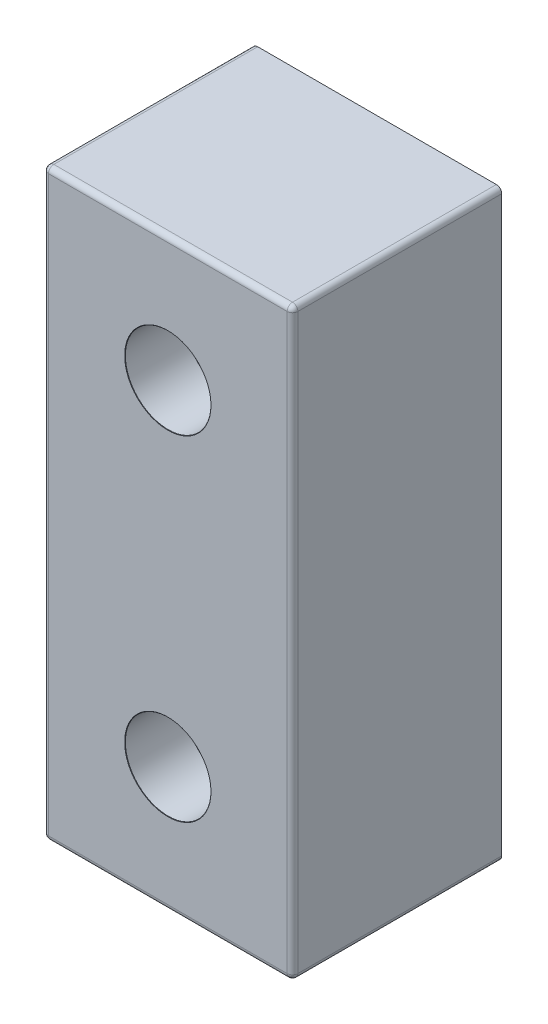
ISO-10303-21;
HEADER;
FILE_DESCRIPTION(('STEP AP214'),'2;1');
FILE_NAME('part.step','',(''),(''),'','','');
FILE_SCHEMA(('AUTOMOTIVE_DESIGN { 1 0 10303 214 1 1 1 1 }'));
ENDSEC;
DATA;
#1=APPLICATION_CONTEXT('core data for automotive mechanical design processes');
#2=APPLICATION_PROTOCOL_DEFINITION('international standard','automotive_design',2000,#1);
#3=PRODUCT_CONTEXT('',#1,'mechanical');
#4=PRODUCT('Part','Part','',(#3));
#5=PRODUCT_RELATED_PRODUCT_CATEGORY('part','',(#4));
#6=PRODUCT_DEFINITION_FORMATION('','',#4);
#7=PRODUCT_DEFINITION_CONTEXT('part definition',#1,'design');
#8=PRODUCT_DEFINITION('design','',#6,#7);
#9=PRODUCT_DEFINITION_SHAPE('','',#8);
#10=(LENGTH_UNIT() NAMED_UNIT(*) SI_UNIT(.MILLI.,.METRE.));
#11=(NAMED_UNIT(*) PLANE_ANGLE_UNIT() SI_UNIT($,.RADIAN.));
#12=(NAMED_UNIT(*) SI_UNIT($,.STERADIAN.) SOLID_ANGLE_UNIT());
#13=UNCERTAINTY_MEASURE_WITH_UNIT(LENGTH_MEASURE(1.E-05),#10,'distance_accuracy_value','');
#14=(GEOMETRIC_REPRESENTATION_CONTEXT(3) GLOBAL_UNCERTAINTY_ASSIGNED_CONTEXT((#13)) GLOBAL_UNIT_ASSIGNED_CONTEXT((#10,
#11,#12)) REPRESENTATION_CONTEXT('',''));
#15=CARTESIAN_POINT('',(0.,0.,0.));
#16=DIRECTION('',(0.,0.,1.));
#17=DIRECTION('',(1.,0.,0.));
#18=AXIS2_PLACEMENT_3D('',#15,#16,#17);
#19=CARTESIAN_POINT('',(0.,0.,15.875));
#20=DIRECTION('',(0.,1.,0.));
#21=DIRECTION('',(0.,0.,1.));
#22=AXIS2_PLACEMENT_3D('',#19,#20,#21);
#23=PLANE('',#22);
#24=DIRECTION('',(1.,0.,0.));
#25=VECTOR('',#24,1.);
#26=CARTESIAN_POINT('',(0.,0.,15.4686));
#27=LINE('',#26,#25);
#28=CARTESIAN_POINT('',(18.5166,0.,15.4686));
#29=VERTEX_POINT('',#28);
#30=CARTESIAN_POINT('',(0.4064,0.,15.4686));
#31=VERTEX_POINT('',#30);
#32=EDGE_CURVE('E60',#29,#31,#27,.F.);
#33=ORIENTED_EDGE('',*,*,#32,.T.);
#34=DIRECTION('',(0.,0.,-1.));
#35=VECTOR('',#34,1.);
#36=CARTESIAN_POINT('',(0.4064,0.,0.));
#37=LINE('',#36,#35);
#38=CARTESIAN_POINT('',(0.4064,0.,0.));
#39=VERTEX_POINT('',#38);
#40=EDGE_CURVE('E185',#31,#39,#37,.T.);
#41=ORIENTED_EDGE('',*,*,#40,.T.);
#42=DIRECTION('',(1.,0.,0.));
#43=VECTOR('',#42,1.);
#44=CARTESIAN_POINT('',(0.,0.,0.));
#45=LINE('',#44,#43);
#46=CARTESIAN_POINT('',(18.5166,0.,0.));
#47=VERTEX_POINT('',#46);
#48=EDGE_CURVE('E126',#39,#47,#45,.T.);
#49=ORIENTED_EDGE('',*,*,#48,.T.);
#50=DIRECTION('',(0.,0.,-1.));
#51=VECTOR('',#50,1.);
#52=CARTESIAN_POINT('',(18.5166,0.,15.875));
#53=LINE('',#52,#51);
#54=EDGE_CURVE('E65',#47,#29,#53,.F.);
#55=ORIENTED_EDGE('',*,*,#54,.T.);
#56=EDGE_LOOP('',(#33,#41,#49,#55));
#57=FACE_BOUND('',#56,.T.);
#58=ADVANCED_FACE('F42',(#57),#23,.F.);
#59=CARTESIAN_POINT('',(18.923,0.,15.875));
#60=DIRECTION('',(-1.,0.,0.));
#61=DIRECTION('',(0.,0.,1.));
#62=AXIS2_PLACEMENT_3D('',#59,#60,#61);
#63=PLANE('',#62);
#64=DIRECTION('',(0.,1.,0.));
#65=VECTOR('',#64,1.);
#66=CARTESIAN_POINT('',(18.923,0.,15.4686));
#67=LINE('',#66,#65);
#68=CARTESIAN_POINT('',(18.923,43.9166,15.4686));
#69=VERTEX_POINT('',#68);
#70=CARTESIAN_POINT('',(18.923,0.4064,15.4686));
#71=VERTEX_POINT('',#70);
#72=EDGE_CURVE('E175',#69,#71,#67,.F.);
#73=ORIENTED_EDGE('',*,*,#72,.T.);
#74=DIRECTION('',(0.,0.,-1.));
#75=VECTOR('',#74,1.);
#76=CARTESIAN_POINT('',(18.923,0.4064,15.875));
#77=LINE('',#76,#75);
#78=CARTESIAN_POINT('',(18.923,0.4064,0.));
#79=VERTEX_POINT('',#78);
#80=EDGE_CURVE('E178',#71,#79,#77,.T.);
#81=ORIENTED_EDGE('',*,*,#80,.T.);
#82=DIRECTION('',(0.,1.,0.));
#83=VECTOR('',#82,1.);
#84=CARTESIAN_POINT('',(18.923,0.,0.));
#85=LINE('',#84,#83);
#86=CARTESIAN_POINT('',(18.923,43.9166,0.));
#87=VERTEX_POINT('',#86);
#88=EDGE_CURVE('E241',#79,#87,#85,.T.);
#89=ORIENTED_EDGE('',*,*,#88,.T.);
#90=DIRECTION('',(0.,0.,-1.));
#91=VECTOR('',#90,1.);
#92=CARTESIAN_POINT('',(18.923,43.9166,15.875));
#93=LINE('',#92,#91);
#94=EDGE_CURVE('E172',#87,#69,#93,.F.);
#95=ORIENTED_EDGE('',*,*,#94,.T.);
#96=EDGE_LOOP('',(#73,#81,#89,#95));
#97=FACE_BOUND('',#96,.T.);
#98=ADVANCED_FACE('F264',(#97),#63,.F.);
#99=CARTESIAN_POINT('',(0.,44.323,15.875));
#100=DIRECTION('',(0.,1.,0.));
#101=DIRECTION('',(0.,0.,1.));
#102=AXIS2_PLACEMENT_3D('',#99,#100,#101);
#103=PLANE('',#102);
#104=DIRECTION('',(1.,0.,0.));
#105=VECTOR('',#104,1.);
#106=CARTESIAN_POINT('',(0.,44.323,0.));
#107=LINE('',#106,#105);
#108=CARTESIAN_POINT('',(0.4064,44.323,0.));
#109=VERTEX_POINT('',#108);
#110=CARTESIAN_POINT('',(18.5166,44.323,0.));
#111=VERTEX_POINT('',#110);
#112=EDGE_CURVE('E137',#109,#111,#107,.T.);
#113=ORIENTED_EDGE('',*,*,#112,.F.);
#114=DIRECTION('',(0.,0.,-1.));
#115=VECTOR('',#114,1.);
#116=CARTESIAN_POINT('',(0.4064,44.323,15.875));
#117=LINE('',#116,#115);
#118=CARTESIAN_POINT('',(0.4064,44.323,15.4686));
#119=VERTEX_POINT('',#118);
#120=EDGE_CURVE('E169',#109,#119,#117,.F.);
#121=ORIENTED_EDGE('',*,*,#120,.T.);
#122=DIRECTION('',(1.,0.,0.));
#123=VECTOR('',#122,1.);
#124=CARTESIAN_POINT('',(0.,44.323,15.4686));
#125=LINE('',#124,#123);
#126=CARTESIAN_POINT('',(18.5166,44.323,15.4686));
#127=VERTEX_POINT('',#126);
#128=EDGE_CURVE('E166',#119,#127,#125,.T.);
#129=ORIENTED_EDGE('',*,*,#128,.T.);
#130=DIRECTION('',(0.,0.,-1.));
#131=VECTOR('',#130,1.);
#132=CARTESIAN_POINT('',(18.5166,44.323,0.));
#133=LINE('',#132,#131);
#134=EDGE_CURVE('E163',#127,#111,#133,.T.);
#135=ORIENTED_EDGE('',*,*,#134,.T.);
#136=EDGE_LOOP('',(#113,#121,#129,#135));
#137=FACE_BOUND('',#136,.T.);
#138=ADVANCED_FACE('F296',(#137),#103,.T.);
#139=CARTESIAN_POINT('',(0.,0.,15.875));
#140=DIRECTION('',(-1.,0.,0.));
#141=DIRECTION('',(0.,0.,1.));
#142=AXIS2_PLACEMENT_3D('',#139,#140,#141);
#143=PLANE('',#142);
#144=DIRECTION('',(0.,1.,0.));
#145=VECTOR('',#144,1.);
#146=CARTESIAN_POINT('',(0.,0.,0.));
#147=LINE('',#146,#145);
#148=CARTESIAN_POINT('',(0.,0.4064,0.));
#149=VERTEX_POINT('',#148);
#150=CARTESIAN_POINT('',(0.,43.9166,0.));
#151=VERTEX_POINT('',#150);
#152=EDGE_CURVE('E124',#149,#151,#147,.T.);
#153=ORIENTED_EDGE('',*,*,#152,.F.);
#154=DIRECTION('',(0.,0.,-1.));
#155=VECTOR('',#154,1.);
#156=CARTESIAN_POINT('',(0.,0.4064,15.875));
#157=LINE('',#156,#155);
#158=CARTESIAN_POINT('',(0.,0.4064,15.4686));
#159=VERTEX_POINT('',#158);
#160=EDGE_CURVE('E132',#149,#159,#157,.F.);
#161=ORIENTED_EDGE('',*,*,#160,.T.);
#162=DIRECTION('',(0.,1.,0.));
#163=VECTOR('',#162,1.);
#164=CARTESIAN_POINT('',(0.,0.,15.4686));
#165=LINE('',#164,#163);
#166=CARTESIAN_POINT('',(0.,43.9166,15.4686));
#167=VERTEX_POINT('',#166);
#168=EDGE_CURVE('E145',#159,#167,#165,.T.);
#169=ORIENTED_EDGE('',*,*,#168,.T.);
#170=DIRECTION('',(0.,0.,-1.));
#171=VECTOR('',#170,1.);
#172=CARTESIAN_POINT('',(0.,43.9166,15.875));
#173=LINE('',#172,#171);
#174=EDGE_CURVE('E135',#167,#151,#173,.T.);
#175=ORIENTED_EDGE('',*,*,#174,.T.);
#176=EDGE_LOOP('',(#153,#161,#169,#175));
#177=FACE_BOUND('',#176,.T.);
#178=ADVANCED_FACE('F130',(#177),#143,.T.);
#179=CARTESIAN_POINT('',(0.,0.,15.875));
#180=DIRECTION('',(0.,0.,1.));
#181=DIRECTION('',(1.,0.,0.));
#182=AXIS2_PLACEMENT_3D('',#179,#180,#181);
#183=PLANE('',#182);
#184=CARTESIAN_POINT('',(9.4615,9.4615,15.875));
#185=DIRECTION('',(0.,0.,1.));
#186=DIRECTION('',(1.,0.,0.));
#187=AXIS2_PLACEMENT_3D('',#184,#185,#186);
#188=CIRCLE('',#187,3.275);
#189=CARTESIAN_POINT('',(12.7365,9.4615,15.875));
#190=VERTEX_POINT('',#189);
#191=EDGE_CURVE('E574',#190,#190,#188,.T.);
#192=ORIENTED_EDGE('',*,*,#191,.F.);
#193=EDGE_LOOP('',(#192));
#194=FACE_BOUND('',#193,.T.);
#195=CARTESIAN_POINT('',(9.4615,34.8615,15.875));
#196=DIRECTION('',(0.,0.,1.));
#197=DIRECTION('',(1.,0.,0.));
#198=AXIS2_PLACEMENT_3D('',#195,#196,#197);
#199=CIRCLE('',#198,3.275);
#200=CARTESIAN_POINT('',(12.7365,34.8615,15.875));
#201=VERTEX_POINT('',#200);
#202=EDGE_CURVE('E577',#201,#201,#199,.T.);
#203=ORIENTED_EDGE('',*,*,#202,.F.);
#204=EDGE_LOOP('',(#203));
#205=FACE_BOUND('',#204,.T.);
#206=DIRECTION('',(1.,0.,0.));
#207=VECTOR('',#206,1.);
#208=CARTESIAN_POINT('',(0.,43.9166,15.875));
#209=LINE('',#208,#207);
#210=CARTESIAN_POINT('',(18.5166,43.9166,15.875));
#211=VERTEX_POINT('',#210);
#212=CARTESIAN_POINT('',(0.4064,43.9166,15.875));
#213=VERTEX_POINT('',#212);
#214=EDGE_CURVE('E156',#211,#213,#209,.F.);
#215=ORIENTED_EDGE('',*,*,#214,.T.);
#216=DIRECTION('',(0.,1.,0.));
#217=VECTOR('',#216,1.);
#218=CARTESIAN_POINT('',(0.4064,0.,15.875));
#219=LINE('',#218,#217);
#220=CARTESIAN_POINT('',(0.4064,0.4064,15.875));
#221=VERTEX_POINT('',#220);
#222=EDGE_CURVE('E159',#213,#221,#219,.F.);
#223=ORIENTED_EDGE('',*,*,#222,.T.);
#224=DIRECTION('',(1.,0.,0.));
#225=VECTOR('',#224,1.);
#226=CARTESIAN_POINT('',(18.923,0.4064,15.875));
#227=LINE('',#226,#225);
#228=CARTESIAN_POINT('',(18.5166,0.4064,15.875));
#229=VERTEX_POINT('',#228);
#230=EDGE_CURVE('E144',#221,#229,#227,.T.);
#231=ORIENTED_EDGE('',*,*,#230,.T.);
#232=DIRECTION('',(0.,1.,0.));
#233=VECTOR('',#232,1.);
#234=CARTESIAN_POINT('',(18.5166,44.323,15.875));
#235=LINE('',#234,#233);
#236=EDGE_CURVE('E149',#229,#211,#235,.T.);
#237=ORIENTED_EDGE('',*,*,#236,.T.);
#238=EDGE_LOOP('',(#215,#223,#231,#237));
#239=FACE_BOUND('',#238,.T.);
#240=ADVANCED_FACE('F272',(#194,#205,#239),#183,.T.);
#241=CARTESIAN_POINT('',(0.,0.,0.));
#242=DIRECTION('',(0.,0.,1.));
#243=DIRECTION('',(1.,0.,0.));
#244=AXIS2_PLACEMENT_3D('',#241,#242,#243);
#245=PLANE('',#244);
#246=CARTESIAN_POINT('',(9.4615,9.4615,0.));
#247=DIRECTION('',(0.,0.,1.));
#248=DIRECTION('',(1.,0.,0.));
#249=AXIS2_PLACEMENT_3D('',#246,#247,#248);
#250=CIRCLE('',#249,1.6);
#251=CARTESIAN_POINT('',(11.0615,9.4615,0.));
#252=VERTEX_POINT('',#251);
#253=EDGE_CURVE('E581',#252,#252,#250,.T.);
#254=ORIENTED_EDGE('',*,*,#253,.T.);
#255=EDGE_LOOP('',(#254));
#256=FACE_BOUND('',#255,.T.);
#257=CARTESIAN_POINT('',(9.4615,34.8615,0.));
#258=DIRECTION('',(0.,0.,1.));
#259=DIRECTION('',(1.,0.,0.));
#260=AXIS2_PLACEMENT_3D('',#257,#258,#259);
#261=CIRCLE('',#260,1.6);
#262=CARTESIAN_POINT('',(11.0615,34.8615,0.));
#263=VERTEX_POINT('',#262);
#264=EDGE_CURVE('E200',#263,#263,#261,.T.);
#265=ORIENTED_EDGE('',*,*,#264,.T.);
#266=EDGE_LOOP('',(#265));
#267=FACE_BOUND('',#266,.T.);
#268=ORIENTED_EDGE('',*,*,#48,.F.);
#269=CARTESIAN_POINT('',(0.4064,0.4064,0.));
#270=DIRECTION('',(0.,0.,1.));
#271=DIRECTION('',(1.,0.,0.));
#272=AXIS2_PLACEMENT_3D('',#269,#270,#271);
#273=CIRCLE('',#272,0.4064);
#274=EDGE_CURVE('E11',#39,#149,#273,.F.);
#275=ORIENTED_EDGE('',*,*,#274,.T.);
#276=ORIENTED_EDGE('',*,*,#152,.T.);
#277=CARTESIAN_POINT('',(0.4064,43.9166,0.));
#278=DIRECTION('',(0.,0.,1.));
#279=DIRECTION('',(1.,0.,0.));
#280=AXIS2_PLACEMENT_3D('',#277,#278,#279);
#281=CIRCLE('',#280,0.4064);
#282=EDGE_CURVE('E191',#151,#109,#281,.F.);
#283=ORIENTED_EDGE('',*,*,#282,.T.);
#284=ORIENTED_EDGE('',*,*,#112,.T.);
#285=CARTESIAN_POINT('',(18.5166,43.9166,0.));
#286=DIRECTION('',(0.,0.,1.));
#287=DIRECTION('',(1.,0.,0.));
#288=AXIS2_PLACEMENT_3D('',#285,#286,#287);
#289=CIRCLE('',#288,0.4064);
#290=EDGE_CURVE('E188',#111,#87,#289,.F.);
#291=ORIENTED_EDGE('',*,*,#290,.T.);
#292=ORIENTED_EDGE('',*,*,#88,.F.);
#293=CARTESIAN_POINT('',(18.5166,0.4064,0.));
#294=DIRECTION('',(0.,0.,1.));
#295=DIRECTION('',(1.,0.,0.));
#296=AXIS2_PLACEMENT_3D('',#293,#294,#295);
#297=CIRCLE('',#296,0.4064);
#298=EDGE_CURVE('E52',#79,#47,#297,.F.);
#299=ORIENTED_EDGE('',*,*,#298,.T.);
#300=EDGE_LOOP('',(#268,#275,#276,#283,#284,#291,#292,#299));
#301=FACE_BOUND('',#300,.T.);
#302=ADVANCED_FACE('F123',(#256,#267,#301),#245,.F.);
#303=CARTESIAN_POINT('',(18.5166,0.4064,15.875));
#304=DIRECTION('',(0.,0.,-1.));
#305=DIRECTION('',(-1.,0.,0.));
#306=AXIS2_PLACEMENT_3D('',#303,#304,#305);
#307=CYLINDRICAL_SURFACE('',#306,0.4064);
#308=ORIENTED_EDGE('',*,*,#298,.F.);
#309=ORIENTED_EDGE('',*,*,#80,.F.);
#310=CARTESIAN_POINT('',(18.5166,0.4064,15.4686));
#311=DIRECTION('',(0.,0.,1.));
#312=DIRECTION('',(1.,0.,0.));
#313=AXIS2_PLACEMENT_3D('',#310,#311,#312);
#314=CIRCLE('',#313,0.4064);
#315=EDGE_CURVE('E232',#29,#71,#314,.T.);
#316=ORIENTED_EDGE('',*,*,#315,.F.);
#317=ORIENTED_EDGE('',*,*,#54,.F.);
#318=EDGE_LOOP('',(#308,#309,#316,#317));
#319=FACE_BOUND('',#318,.T.);
#320=ADVANCED_FACE('F44',(#319),#307,.T.);
#321=CARTESIAN_POINT('',(18.5166,43.9166,15.875));
#322=DIRECTION('',(0.,0.,1.));
#323=DIRECTION('',(1.,0.,0.));
#324=AXIS2_PLACEMENT_3D('',#321,#322,#323);
#325=CYLINDRICAL_SURFACE('',#324,0.4064);
#326=ORIENTED_EDGE('',*,*,#290,.F.);
#327=ORIENTED_EDGE('',*,*,#134,.F.);
#328=CARTESIAN_POINT('',(18.5166,43.9166,15.4686));
#329=DIRECTION('',(0.,0.,1.));
#330=DIRECTION('',(1.,0.,0.));
#331=AXIS2_PLACEMENT_3D('',#328,#329,#330);
#332=CIRCLE('',#331,0.4064);
#333=EDGE_CURVE('E229',#69,#127,#332,.T.);
#334=ORIENTED_EDGE('',*,*,#333,.F.);
#335=ORIENTED_EDGE('',*,*,#94,.F.);
#336=EDGE_LOOP('',(#326,#327,#334,#335));
#337=FACE_BOUND('',#336,.T.);
#338=ADVANCED_FACE('F260',(#337),#325,.T.);
#339=CARTESIAN_POINT('',(18.5166,0.,15.4686));
#340=DIRECTION('',(0.,-1.,0.));
#341=DIRECTION('',(0.,0.,-1.));
#342=AXIS2_PLACEMENT_3D('',#339,#340,#341);
#343=CYLINDRICAL_SURFACE('',#342,0.4064);
#344=CARTESIAN_POINT('',(18.5166,0.4064,15.4686));
#345=DIRECTION('',(0.,-1.,0.));
#346=DIRECTION('',(0.,0.,-1.));
#347=AXIS2_PLACEMENT_3D('',#344,#345,#346);
#348=CIRCLE('',#347,0.4064);
#349=EDGE_CURVE('E46',#71,#229,#348,.T.);
#350=ORIENTED_EDGE('',*,*,#349,.F.);
#351=ORIENTED_EDGE('',*,*,#72,.F.);
#352=CARTESIAN_POINT('',(18.5166,43.9166,15.4686));
#353=DIRECTION('',(0.,1.,0.));
#354=DIRECTION('',(0.,0.,1.));
#355=AXIS2_PLACEMENT_3D('',#352,#353,#354);
#356=CIRCLE('',#355,0.4064);
#357=EDGE_CURVE('E225',#211,#69,#356,.T.);
#358=ORIENTED_EDGE('',*,*,#357,.F.);
#359=ORIENTED_EDGE('',*,*,#236,.F.);
#360=EDGE_LOOP('',(#350,#351,#358,#359));
#361=FACE_BOUND('',#360,.T.);
#362=ADVANCED_FACE('F268',(#361),#343,.T.);
#363=CARTESIAN_POINT('',(18.5166,0.4064,15.4686));
#364=DIRECTION('',(1.,0.,0.));
#365=DIRECTION('',(0.,0.,-1.));
#366=AXIS2_PLACEMENT_3D('',#363,#364,#365);
#367=SPHERICAL_SURFACE('',#366,0.4064);
#368=ORIENTED_EDGE('',*,*,#315,.T.);
#369=ORIENTED_EDGE('',*,*,#349,.T.);
#370=CARTESIAN_POINT('',(18.5166,0.4064,15.4686));
#371=DIRECTION('',(1.,0.,0.));
#372=DIRECTION('',(0.,0.,-1.));
#373=AXIS2_PLACEMENT_3D('',#370,#371,#372);
#374=CIRCLE('',#373,0.4064);
#375=EDGE_CURVE('E221',#29,#229,#374,.F.);
#376=ORIENTED_EDGE('',*,*,#375,.F.);
#377=EDGE_LOOP('',(#368,#369,#376));
#378=FACE_BOUND('',#377,.T.);
#379=ADVANCED_FACE('F280',(#378),#367,.T.);
#380=CARTESIAN_POINT('',(18.5166,43.9166,15.4686));
#381=DIRECTION('',(1.,0.,0.));
#382=DIRECTION('',(0.,0.,-1.));
#383=AXIS2_PLACEMENT_3D('',#380,#381,#382);
#384=SPHERICAL_SURFACE('',#383,0.4064);
#385=ORIENTED_EDGE('',*,*,#357,.T.);
#386=ORIENTED_EDGE('',*,*,#333,.T.);
#387=CARTESIAN_POINT('',(18.5166,43.9166,15.4686));
#388=DIRECTION('',(1.,0.,0.));
#389=DIRECTION('',(0.,0.,-1.));
#390=AXIS2_PLACEMENT_3D('',#387,#388,#389);
#391=CIRCLE('',#390,0.4064);
#392=EDGE_CURVE('E217',#211,#127,#391,.F.);
#393=ORIENTED_EDGE('',*,*,#392,.F.);
#394=EDGE_LOOP('',(#385,#386,#393));
#395=FACE_BOUND('',#394,.T.);
#396=ADVANCED_FACE('F282',(#395),#384,.T.);
#397=CARTESIAN_POINT('',(0.,0.4064,15.4686));
#398=DIRECTION('',(-1.,0.,0.));
#399=DIRECTION('',(0.,0.,1.));
#400=AXIS2_PLACEMENT_3D('',#397,#398,#399);
#401=CYLINDRICAL_SURFACE('',#400,0.4064);
#402=ORIENTED_EDGE('',*,*,#375,.T.);
#403=ORIENTED_EDGE('',*,*,#230,.F.);
#404=CARTESIAN_POINT('',(0.4064,0.4064,15.4686));
#405=DIRECTION('',(-1.,0.,0.));
#406=DIRECTION('',(0.,0.,1.));
#407=AXIS2_PLACEMENT_3D('',#404,#405,#406);
#408=CIRCLE('',#407,0.4064);
#409=EDGE_CURVE('E213',#31,#221,#408,.T.);
#410=ORIENTED_EDGE('',*,*,#409,.F.);
#411=ORIENTED_EDGE('',*,*,#32,.F.);
#412=EDGE_LOOP('',(#402,#403,#410,#411));
#413=FACE_BOUND('',#412,.T.);
#414=ADVANCED_FACE('F279',(#413),#401,.T.);
#415=CARTESIAN_POINT('',(0.4064,0.4064,15.875));
#416=DIRECTION('',(0.,0.,1.));
#417=DIRECTION('',(1.,0.,0.));
#418=AXIS2_PLACEMENT_3D('',#415,#416,#417);
#419=CYLINDRICAL_SURFACE('',#418,0.4064);
#420=ORIENTED_EDGE('',*,*,#274,.F.);
#421=ORIENTED_EDGE('',*,*,#40,.F.);
#422=CARTESIAN_POINT('',(0.4064,0.4064,15.4686));
#423=DIRECTION('',(0.,0.,1.));
#424=DIRECTION('',(1.,0.,0.));
#425=AXIS2_PLACEMENT_3D('',#422,#423,#424);
#426=CIRCLE('',#425,0.4064);
#427=EDGE_CURVE('E141',#159,#31,#426,.T.);
#428=ORIENTED_EDGE('',*,*,#427,.F.);
#429=ORIENTED_EDGE('',*,*,#160,.F.);
#430=EDGE_LOOP('',(#420,#421,#428,#429));
#431=FACE_BOUND('',#430,.T.);
#432=ADVANCED_FACE('F139',(#431),#419,.T.);
#433=CARTESIAN_POINT('',(0.4064,43.9166,15.875));
#434=DIRECTION('',(0.,0.,-1.));
#435=DIRECTION('',(-1.,0.,0.));
#436=AXIS2_PLACEMENT_3D('',#433,#434,#435);
#437=CYLINDRICAL_SURFACE('',#436,0.4064);
#438=ORIENTED_EDGE('',*,*,#282,.F.);
#439=ORIENTED_EDGE('',*,*,#174,.F.);
#440=CARTESIAN_POINT('',(0.4064,43.9166,15.4686));
#441=DIRECTION('',(0.,0.,1.));
#442=DIRECTION('',(1.,0.,0.));
#443=AXIS2_PLACEMENT_3D('',#440,#441,#442);
#444=CIRCLE('',#443,0.4064);
#445=EDGE_CURVE('E207',#119,#167,#444,.T.);
#446=ORIENTED_EDGE('',*,*,#445,.F.);
#447=ORIENTED_EDGE('',*,*,#120,.F.);
#448=EDGE_LOOP('',(#438,#439,#446,#447));
#449=FACE_BOUND('',#448,.T.);
#450=ADVANCED_FACE('F316',(#449),#437,.T.);
#451=CARTESIAN_POINT('',(0.,43.9166,15.4686));
#452=DIRECTION('',(1.,0.,0.));
#453=DIRECTION('',(0.,0.,-1.));
#454=AXIS2_PLACEMENT_3D('',#451,#452,#453);
#455=CYLINDRICAL_SURFACE('',#454,0.4064);
#456=ORIENTED_EDGE('',*,*,#392,.T.);
#457=ORIENTED_EDGE('',*,*,#128,.F.);
#458=CARTESIAN_POINT('',(0.4064,43.9166,15.4686));
#459=DIRECTION('',(-1.,0.,0.));
#460=DIRECTION('',(0.,0.,1.));
#461=AXIS2_PLACEMENT_3D('',#458,#459,#460);
#462=CIRCLE('',#461,0.4064);
#463=EDGE_CURVE('E203',#213,#119,#462,.T.);
#464=ORIENTED_EDGE('',*,*,#463,.F.);
#465=ORIENTED_EDGE('',*,*,#214,.F.);
#466=EDGE_LOOP('',(#456,#457,#464,#465));
#467=FACE_BOUND('',#466,.T.);
#468=ADVANCED_FACE('F312',(#467),#455,.T.);
#469=CARTESIAN_POINT('',(0.4064,0.4064,15.4686));
#470=DIRECTION('',(0.,-1.,0.));
#471=DIRECTION('',(0.,0.,-1.));
#472=AXIS2_PLACEMENT_3D('',#469,#470,#471);
#473=SPHERICAL_SURFACE('',#472,0.4064);
#474=ORIENTED_EDGE('',*,*,#427,.T.);
#475=ORIENTED_EDGE('',*,*,#409,.T.);
#476=CARTESIAN_POINT('',(0.4064,0.4064,15.4686));
#477=DIRECTION('',(0.,-1.,0.));
#478=DIRECTION('',(0.,0.,-1.));
#479=AXIS2_PLACEMENT_3D('',#476,#477,#478);
#480=CIRCLE('',#479,0.4064);
#481=EDGE_CURVE('E199',#159,#221,#480,.F.);
#482=ORIENTED_EDGE('',*,*,#481,.F.);
#483=EDGE_LOOP('',(#474,#475,#482));
#484=FACE_BOUND('',#483,.T.);
#485=ADVANCED_FACE('F308',(#484),#473,.T.);
#486=CARTESIAN_POINT('',(0.4064,43.9166,15.4686));
#487=DIRECTION('',(0.,1.,0.));
#488=DIRECTION('',(0.,0.,1.));
#489=AXIS2_PLACEMENT_3D('',#486,#487,#488);
#490=SPHERICAL_SURFACE('',#489,0.4064);
#491=ORIENTED_EDGE('',*,*,#463,.T.);
#492=ORIENTED_EDGE('',*,*,#445,.T.);
#493=CARTESIAN_POINT('',(0.4064,43.9166,15.4686));
#494=DIRECTION('',(0.,1.,0.));
#495=DIRECTION('',(0.,0.,1.));
#496=AXIS2_PLACEMENT_3D('',#493,#494,#495);
#497=CIRCLE('',#496,0.4064);
#498=EDGE_CURVE('E196',#213,#167,#497,.F.);
#499=ORIENTED_EDGE('',*,*,#498,.F.);
#500=EDGE_LOOP('',(#491,#492,#499));
#501=FACE_BOUND('',#500,.T.);
#502=ADVANCED_FACE('F304',(#501),#490,.T.);
#503=CARTESIAN_POINT('',(0.4064,0.,15.4686));
#504=DIRECTION('',(0.,1.,0.));
#505=DIRECTION('',(0.,0.,1.));
#506=AXIS2_PLACEMENT_3D('',#503,#504,#505);
#507=CYLINDRICAL_SURFACE('',#506,0.4064);
#508=ORIENTED_EDGE('',*,*,#481,.T.);
#509=ORIENTED_EDGE('',*,*,#222,.F.);
#510=ORIENTED_EDGE('',*,*,#498,.T.);
#511=ORIENTED_EDGE('',*,*,#168,.F.);
#512=EDGE_LOOP('',(#508,#509,#510,#511));
#513=FACE_BOUND('',#512,.T.);
#514=ADVANCED_FACE('F300',(#513),#507,.T.);
#515=CARTESIAN_POINT('',(9.4615,34.8615,15.875));
#516=DIRECTION('',(0.,0.,1.));
#517=DIRECTION('',(1.,0.,0.));
#518=AXIS2_PLACEMENT_3D('',#515,#516,#517);
#519=CYLINDRICAL_SURFACE('',#518,1.6);
#520=ORIENTED_EDGE('',*,*,#264,.F.);
#521=EDGE_LOOP('',(#520));
#522=FACE_BOUND('',#521,.T.);
#523=CARTESIAN_POINT('',(9.4615,34.8615,11.2875));
#524=DIRECTION('',(0.,0.,1.));
#525=DIRECTION('',(1.,0.,0.));
#526=AXIS2_PLACEMENT_3D('',#523,#524,#525);
#527=CIRCLE('',#526,1.6);
#528=CARTESIAN_POINT('',(11.0615,34.8615,11.2875));
#529=VERTEX_POINT('',#528);
#530=EDGE_CURVE('E595',#529,#529,#527,.T.);
#531=ORIENTED_EDGE('',*,*,#530,.T.);
#532=EDGE_LOOP('',(#531));
#533=FACE_BOUND('',#532,.T.);
#534=ADVANCED_FACE('F303',(#522,#533),#519,.F.);
#535=CARTESIAN_POINT('',(12.7115,34.8615,11.2875));
#536=DIRECTION('',(0.,0.,-1.));
#537=DIRECTION('',(-1.,0.,0.));
#538=AXIS2_PLACEMENT_3D('',#535,#536,#537);
#539=PLANE('',#538);
#540=ORIENTED_EDGE('',*,*,#530,.F.);
#541=EDGE_LOOP('',(#540));
#542=FACE_BOUND('',#541,.T.);
#543=CARTESIAN_POINT('',(9.4615,34.8615,11.2875));
#544=DIRECTION('',(0.,0.,1.));
#545=DIRECTION('',(1.,0.,0.));
#546=AXIS2_PLACEMENT_3D('',#543,#544,#545);
#547=CIRCLE('',#546,3.25);
#548=CARTESIAN_POINT('',(12.7115,34.8615,11.2875));
#549=VERTEX_POINT('',#548);
#550=EDGE_CURVE('E586',#549,#549,#547,.T.);
#551=ORIENTED_EDGE('',*,*,#550,.T.);
#552=EDGE_LOOP('',(#551));
#553=FACE_BOUND('',#552,.T.);
#554=ADVANCED_FACE('F359',(#542,#553),#539,.F.);
#555=CARTESIAN_POINT('',(9.4615,34.8615,15.875));
#556=DIRECTION('',(0.,0.,1.));
#557=DIRECTION('',(1.,0.,0.));
#558=AXIS2_PLACEMENT_3D('',#555,#556,#557);
#559=CYLINDRICAL_SURFACE('',#558,3.25);
#560=ORIENTED_EDGE('',*,*,#550,.F.);
#561=EDGE_LOOP('',(#560));
#562=FACE_BOUND('',#561,.T.);
#563=CARTESIAN_POINT('',(9.4615,34.8615,15.85));
#564=DIRECTION('',(0.,0.,1.));
#565=DIRECTION('',(1.,0.,0.));
#566=AXIS2_PLACEMENT_3D('',#563,#564,#565);
#567=CIRCLE('',#566,3.25);
#568=CARTESIAN_POINT('',(12.7115,34.8615,15.85));
#569=VERTEX_POINT('',#568);
#570=EDGE_CURVE('E580',#569,#569,#567,.T.);
#571=ORIENTED_EDGE('',*,*,#570,.T.);
#572=EDGE_LOOP('',(#571));
#573=FACE_BOUND('',#572,.T.);
#574=ADVANCED_FACE('F368',(#562,#573),#559,.F.);
#575=CARTESIAN_POINT('',(9.4615,34.8615,15.875));
#576=DIRECTION('',(0.,0.,1.));
#577=DIRECTION('',(1.,0.,0.));
#578=AXIS2_PLACEMENT_3D('',#575,#576,#577);
#579=CONICAL_SURFACE('',#578,3.275,0.785398163397379);
#580=ORIENTED_EDGE('',*,*,#570,.F.);
#581=EDGE_LOOP('',(#580));
#582=FACE_BOUND('',#581,.T.);
#583=ORIENTED_EDGE('',*,*,#202,.T.);
#584=EDGE_LOOP('',(#583));
#585=FACE_BOUND('',#584,.T.);
#586=ADVANCED_FACE('F376',(#582,#585),#579,.F.);
#587=CARTESIAN_POINT('',(9.4615,9.4615,15.875));
#588=DIRECTION('',(0.,0.,1.));
#589=DIRECTION('',(1.,0.,0.));
#590=AXIS2_PLACEMENT_3D('',#587,#588,#589);
#591=CYLINDRICAL_SURFACE('',#590,1.6);
#592=ORIENTED_EDGE('',*,*,#253,.F.);
#593=EDGE_LOOP('',(#592));
#594=FACE_BOUND('',#593,.T.);
#595=CARTESIAN_POINT('',(9.4615,9.4615,11.2875));
#596=DIRECTION('',(0.,0.,1.));
#597=DIRECTION('',(1.,0.,0.));
#598=AXIS2_PLACEMENT_3D('',#595,#596,#597);
#599=CIRCLE('',#598,1.6);
#600=CARTESIAN_POINT('',(11.0615,9.4615,11.2875));
#601=VERTEX_POINT('',#600);
#602=EDGE_CURVE('E589',#601,#601,#599,.T.);
#603=ORIENTED_EDGE('',*,*,#602,.T.);
#604=EDGE_LOOP('',(#603));
#605=FACE_BOUND('',#604,.T.);
#606=ADVANCED_FACE('F384',(#594,#605),#591,.F.);
#607=CARTESIAN_POINT('',(12.7115,9.4615,11.2875));
#608=DIRECTION('',(0.,0.,-1.));
#609=DIRECTION('',(-1.,0.,0.));
#610=AXIS2_PLACEMENT_3D('',#607,#608,#609);
#611=PLANE('',#610);
#612=ORIENTED_EDGE('',*,*,#602,.F.);
#613=EDGE_LOOP('',(#612));
#614=FACE_BOUND('',#613,.T.);
#615=CARTESIAN_POINT('',(9.4615,9.4615,11.2875));
#616=DIRECTION('',(0.,0.,1.));
#617=DIRECTION('',(1.,0.,0.));
#618=AXIS2_PLACEMENT_3D('',#615,#616,#617);
#619=CIRCLE('',#618,3.25);
#620=CARTESIAN_POINT('',(12.7115,9.4615,11.2875));
#621=VERTEX_POINT('',#620);
#622=EDGE_CURVE('E611',#621,#621,#619,.T.);
#623=ORIENTED_EDGE('',*,*,#622,.T.);
#624=EDGE_LOOP('',(#623));
#625=FACE_BOUND('',#624,.T.);
#626=ADVANCED_FACE('F392',(#614,#625),#611,.F.);
#627=CARTESIAN_POINT('',(9.4615,9.4615,15.875));
#628=DIRECTION('',(0.,0.,1.));
#629=DIRECTION('',(1.,0.,0.));
#630=AXIS2_PLACEMENT_3D('',#627,#628,#629);
#631=CYLINDRICAL_SURFACE('',#630,3.25);
#632=ORIENTED_EDGE('',*,*,#622,.F.);
#633=EDGE_LOOP('',(#632));
#634=FACE_BOUND('',#633,.T.);
#635=CARTESIAN_POINT('',(9.4615,9.4615,15.85));
#636=DIRECTION('',(0.,0.,1.));
#637=DIRECTION('',(1.,0.,0.));
#638=AXIS2_PLACEMENT_3D('',#635,#636,#637);
#639=CIRCLE('',#638,3.25);
#640=CARTESIAN_POINT('',(12.7115,9.4615,15.85));
#641=VERTEX_POINT('',#640);
#642=EDGE_CURVE('E615',#641,#641,#639,.T.);
#643=ORIENTED_EDGE('',*,*,#642,.T.);
#644=EDGE_LOOP('',(#643));
#645=FACE_BOUND('',#644,.T.);
#646=ADVANCED_FACE('F400',(#634,#645),#631,.F.);
#647=CARTESIAN_POINT('',(9.4615,9.4615,15.875));
#648=DIRECTION('',(0.,0.,1.));
#649=DIRECTION('',(1.,0.,0.));
#650=AXIS2_PLACEMENT_3D('',#647,#648,#649);
#651=CONICAL_SURFACE('',#650,3.275,0.785398163397379);
#652=ORIENTED_EDGE('',*,*,#642,.F.);
#653=EDGE_LOOP('',(#652));
#654=FACE_BOUND('',#653,.T.);
#655=ORIENTED_EDGE('',*,*,#191,.T.);
#656=EDGE_LOOP('',(#655));
#657=FACE_BOUND('',#656,.T.);
#658=ADVANCED_FACE('F408',(#654,#657),#651,.F.);
#659=CLOSED_SHELL('',(#58,#98,#138,#178,#240,#302,#320,#338,#362,#379,#396,#414,#432,#450,#468,
#485,#502,#514,#534,#554,#574,#586,#606,#626,#646,#658));
#660=MANIFOLD_SOLID_BREP('B2',#659);
#661=ADVANCED_BREP_SHAPE_REPRESENTATION('',(#18,#660),#14);
#662=SHAPE_DEFINITION_REPRESENTATION(#9,#661);
ENDSEC;
END-ISO-10303-21;
